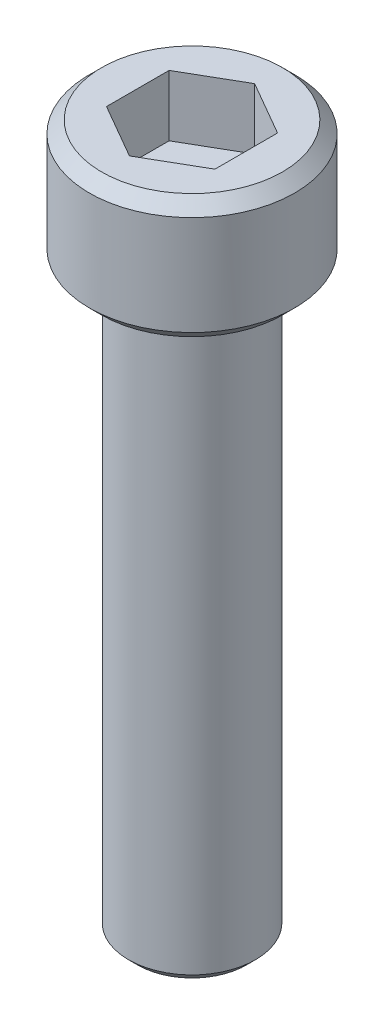
ISO-10303-21;
HEADER;
FILE_DESCRIPTION(('STEP AP214'),'2;1');
FILE_NAME('part.step','',(''),(''),'','','');
FILE_SCHEMA(('AUTOMOTIVE_DESIGN { 1 0 10303 214 1 1 1 1 }'));
ENDSEC;
DATA;
#1=APPLICATION_CONTEXT('core data for automotive mechanical design processes');
#2=APPLICATION_PROTOCOL_DEFINITION('international standard','automotive_design',2000,#1);
#3=PRODUCT_CONTEXT('',#1,'mechanical');
#4=PRODUCT('Part','Part','',(#3));
#5=PRODUCT_RELATED_PRODUCT_CATEGORY('part','',(#4));
#6=PRODUCT_DEFINITION_FORMATION('','',#4);
#7=PRODUCT_DEFINITION_CONTEXT('part definition',#1,'design');
#8=PRODUCT_DEFINITION('design','',#6,#7);
#9=PRODUCT_DEFINITION_SHAPE('','',#8);
#10=(LENGTH_UNIT() NAMED_UNIT(*) SI_UNIT(.MILLI.,.METRE.));
#11=(NAMED_UNIT(*) PLANE_ANGLE_UNIT() SI_UNIT($,.RADIAN.));
#12=(NAMED_UNIT(*) SI_UNIT($,.STERADIAN.) SOLID_ANGLE_UNIT());
#13=UNCERTAINTY_MEASURE_WITH_UNIT(LENGTH_MEASURE(1.E-05),#10,'distance_accuracy_value','');
#14=(GEOMETRIC_REPRESENTATION_CONTEXT(3) GLOBAL_UNCERTAINTY_ASSIGNED_CONTEXT((#13)) GLOBAL_UNIT_ASSIGNED_CONTEXT((#10,
#11,#12)) REPRESENTATION_CONTEXT('',''));
#15=CARTESIAN_POINT('',(0.,0.,0.));
#16=DIRECTION('',(0.,0.,1.));
#17=DIRECTION('',(1.,0.,0.));
#18=AXIS2_PLACEMENT_3D('',#15,#16,#17);
#19=CARTESIAN_POINT('',(1.778,2.064,3.07958633585746));
#20=DIRECTION('',(0.,1.,0.));
#21=DIRECTION('',(0.,0.,1.));
#22=AXIS2_PLACEMENT_3D('',#19,#20,#21);
#23=PLANE('',#22);
#24=DIRECTION('',(-0.866025403784439,0.,0.5));
#25=VECTOR('',#24,1.);
#26=CARTESIAN_POINT('',(0.,2.064,-2.05305755723831));
#27=LINE('',#26,#25);
#28=CARTESIAN_POINT('',(0.,2.064,-2.05305755723831));
#29=VERTEX_POINT('',#28);
#30=CARTESIAN_POINT('',(-1.778,2.064,-1.02652877861915));
#31=VERTEX_POINT('',#30);
#32=EDGE_CURVE('E67',#29,#31,#27,.T.);
#33=ORIENTED_EDGE('',*,*,#32,.T.);
#34=DIRECTION('',(0.,0.,1.));
#35=VECTOR('',#34,1.);
#36=CARTESIAN_POINT('',(-1.778,2.064,-1.02652877861915));
#37=LINE('',#36,#35);
#38=CARTESIAN_POINT('',(-1.778,2.064,1.02652877861916));
#39=VERTEX_POINT('',#38);
#40=EDGE_CURVE('E69',#31,#39,#37,.T.);
#41=ORIENTED_EDGE('',*,*,#40,.T.);
#42=DIRECTION('',(0.866025403784439,0.,0.499999999999999));
#43=VECTOR('',#42,1.);
#44=CARTESIAN_POINT('',(-1.778,2.064,1.02652877861916));
#45=LINE('',#44,#43);
#46=CARTESIAN_POINT('',(0.,2.064,2.05305755723831));
#47=VERTEX_POINT('',#46);
#48=EDGE_CURVE('E71',#39,#47,#45,.T.);
#49=ORIENTED_EDGE('',*,*,#48,.T.);
#50=DIRECTION('',(0.866025403784438,0.,-0.500000000000001));
#51=VECTOR('',#50,1.);
#52=CARTESIAN_POINT('',(0.,2.064,2.05305755723831));
#53=LINE('',#52,#51);
#54=CARTESIAN_POINT('',(1.778,2.064,1.02652877861915));
#55=VERTEX_POINT('',#54);
#56=EDGE_CURVE('E126',#47,#55,#53,.T.);
#57=ORIENTED_EDGE('',*,*,#56,.T.);
#58=DIRECTION('',(0.,0.,-1.));
#59=VECTOR('',#58,1.);
#60=CARTESIAN_POINT('',(1.778,2.064,1.02652877861915));
#61=LINE('',#60,#59);
#62=CARTESIAN_POINT('',(1.778,2.064,-1.02652877861916));
#63=VERTEX_POINT('',#62);
#64=EDGE_CURVE('E131',#55,#63,#61,.T.);
#65=ORIENTED_EDGE('',*,*,#64,.T.);
#66=DIRECTION('',(-0.866025403784439,0.,-0.499999999999999));
#67=VECTOR('',#66,1.);
#68=CARTESIAN_POINT('',(1.778,2.064,-1.02652877861916));
#69=LINE('',#68,#67);
#70=EDGE_CURVE('E135',#63,#29,#69,.T.);
#71=ORIENTED_EDGE('',*,*,#70,.T.);
#72=EDGE_LOOP('',(#33,#41,#49,#57,#65,#71));
#73=FACE_BOUND('',#72,.T.);
#74=ADVANCED_FACE('F16',(#73),#23,.T.);
#75=CARTESIAN_POINT('',(-1.778,2.064,1.02652877861916));
#76=DIRECTION('',(-0.499999999999999,0.,0.866025403784439));
#77=DIRECTION('',(0.866025403784439,0.,0.499999999999999));
#78=AXIS2_PLACEMENT_3D('',#75,#76,#77);
#79=PLANE('',#78);
#80=DIRECTION('',(0.,1.,0.));
#81=VECTOR('',#80,1.);
#82=CARTESIAN_POINT('',(0.,2.064,2.05305755723831));
#83=LINE('',#82,#81);
#84=CARTESIAN_POINT('',(0.,4.064,2.05305755723831));
#85=VERTEX_POINT('',#84);
#86=EDGE_CURVE('E82',#85,#47,#83,.F.);
#87=ORIENTED_EDGE('',*,*,#86,.T.);
#88=ORIENTED_EDGE('',*,*,#48,.F.);
#89=DIRECTION('',(0.,1.,0.));
#90=VECTOR('',#89,1.);
#91=CARTESIAN_POINT('',(-1.778,2.064,1.02652877861916));
#92=LINE('',#91,#90);
#93=CARTESIAN_POINT('',(-1.778,4.064,1.02652877861916));
#94=VERTEX_POINT('',#93);
#95=EDGE_CURVE('E76',#39,#94,#92,.T.);
#96=ORIENTED_EDGE('',*,*,#95,.T.);
#97=DIRECTION('',(-0.866025403784439,0.,-0.5));
#98=VECTOR('',#97,1.);
#99=CARTESIAN_POINT('',(0.,4.064,2.05305755723831));
#100=LINE('',#99,#98);
#101=EDGE_CURVE('E123',#85,#94,#100,.T.);
#102=ORIENTED_EDGE('',*,*,#101,.F.);
#103=EDGE_LOOP('',(#87,#88,#96,#102));
#104=FACE_BOUND('',#103,.T.);
#105=ADVANCED_FACE('F79',(#104),#79,.F.);
#106=CARTESIAN_POINT('',(-1.778,2.064,-1.02652877861915));
#107=DIRECTION('',(-1.,0.,0.));
#108=DIRECTION('',(0.,0.,1.));
#109=AXIS2_PLACEMENT_3D('',#106,#107,#108);
#110=PLANE('',#109);
#111=ORIENTED_EDGE('',*,*,#95,.F.);
#112=ORIENTED_EDGE('',*,*,#40,.F.);
#113=DIRECTION('',(0.,1.,0.));
#114=VECTOR('',#113,1.);
#115=CARTESIAN_POINT('',(-1.778,2.064,-1.02652877861915));
#116=LINE('',#115,#114);
#117=CARTESIAN_POINT('',(-1.778,4.064,-1.02652877861915));
#118=VERTEX_POINT('',#117);
#119=EDGE_CURVE('E90',#31,#118,#116,.T.);
#120=ORIENTED_EDGE('',*,*,#119,.T.);
#121=DIRECTION('',(0.,0.,1.));
#122=VECTOR('',#121,1.);
#123=CARTESIAN_POINT('',(-1.778,4.064,0.));
#124=LINE('',#123,#122);
#125=EDGE_CURVE('E87',#94,#118,#124,.F.);
#126=ORIENTED_EDGE('',*,*,#125,.F.);
#127=EDGE_LOOP('',(#111,#112,#120,#126));
#128=FACE_BOUND('',#127,.T.);
#129=ADVANCED_FACE('F85',(#128),#110,.F.);
#130=CARTESIAN_POINT('',(0.,2.064,-2.05305755723831));
#131=DIRECTION('',(-0.5,0.,-0.866025403784439));
#132=DIRECTION('',(-0.866025403784439,0.,0.5));
#133=AXIS2_PLACEMENT_3D('',#130,#131,#132);
#134=PLANE('',#133);
#135=ORIENTED_EDGE('',*,*,#119,.F.);
#136=ORIENTED_EDGE('',*,*,#32,.F.);
#137=DIRECTION('',(0.,1.,0.));
#138=VECTOR('',#137,1.);
#139=CARTESIAN_POINT('',(0.,2.064,-2.05305755723831));
#140=LINE('',#139,#138);
#141=CARTESIAN_POINT('',(0.,4.064,-2.05305755723831));
#142=VERTEX_POINT('',#141);
#143=EDGE_CURVE('E133',#29,#142,#140,.T.);
#144=ORIENTED_EDGE('',*,*,#143,.T.);
#145=DIRECTION('',(0.866025403784438,0.,-0.5));
#146=VECTOR('',#145,1.);
#147=CARTESIAN_POINT('',(-1.778,4.064,-1.02652877861915));
#148=LINE('',#147,#146);
#149=EDGE_CURVE('E119',#118,#142,#148,.T.);
#150=ORIENTED_EDGE('',*,*,#149,.F.);
#151=EDGE_LOOP('',(#135,#136,#144,#150));
#152=FACE_BOUND('',#151,.T.);
#153=ADVANCED_FACE('F138',(#152),#134,.F.);
#154=CARTESIAN_POINT('',(1.778,2.064,-1.02652877861916));
#155=DIRECTION('',(0.499999999999999,0.,-0.866025403784439));
#156=DIRECTION('',(-0.866025403784439,0.,-0.499999999999999));
#157=AXIS2_PLACEMENT_3D('',#154,#155,#156);
#158=PLANE('',#157);
#159=ORIENTED_EDGE('',*,*,#143,.F.);
#160=ORIENTED_EDGE('',*,*,#70,.F.);
#161=DIRECTION('',(0.,1.,0.));
#162=VECTOR('',#161,1.);
#163=CARTESIAN_POINT('',(1.778,2.064,-1.02652877861916));
#164=LINE('',#163,#162);
#165=CARTESIAN_POINT('',(1.778,4.064,-1.02652877861916));
#166=VERTEX_POINT('',#165);
#167=EDGE_CURVE('E129',#63,#166,#164,.T.);
#168=ORIENTED_EDGE('',*,*,#167,.T.);
#169=DIRECTION('',(0.866025403784439,0.,0.5));
#170=VECTOR('',#169,1.);
#171=CARTESIAN_POINT('',(0.,4.064,-2.05305755723831));
#172=LINE('',#171,#170);
#173=EDGE_CURVE('E116',#142,#166,#172,.T.);
#174=ORIENTED_EDGE('',*,*,#173,.F.);
#175=EDGE_LOOP('',(#159,#160,#168,#174));
#176=FACE_BOUND('',#175,.T.);
#177=ADVANCED_FACE('F150',(#176),#158,.F.);
#178=CARTESIAN_POINT('',(1.778,2.064,1.02652877861915));
#179=DIRECTION('',(1.,0.,0.));
#180=DIRECTION('',(0.,0.,-1.));
#181=AXIS2_PLACEMENT_3D('',#178,#179,#180);
#182=PLANE('',#181);
#183=ORIENTED_EDGE('',*,*,#167,.F.);
#184=ORIENTED_EDGE('',*,*,#64,.F.);
#185=DIRECTION('',(0.,1.,0.));
#186=VECTOR('',#185,1.);
#187=CARTESIAN_POINT('',(1.778,2.064,1.02652877861915));
#188=LINE('',#187,#186);
#189=CARTESIAN_POINT('',(1.778,4.064,1.02652877861915));
#190=VERTEX_POINT('',#189);
#191=EDGE_CURVE('E34',#55,#190,#188,.T.);
#192=ORIENTED_EDGE('',*,*,#191,.T.);
#193=DIRECTION('',(0.,0.,1.));
#194=VECTOR('',#193,1.);
#195=CARTESIAN_POINT('',(1.778,4.064,0.));
#196=LINE('',#195,#194);
#197=EDGE_CURVE('E113',#166,#190,#196,.T.);
#198=ORIENTED_EDGE('',*,*,#197,.F.);
#199=EDGE_LOOP('',(#183,#184,#192,#198));
#200=FACE_BOUND('',#199,.T.);
#201=ADVANCED_FACE('F148',(#200),#182,.F.);
#202=CARTESIAN_POINT('',(0.,2.064,2.05305755723831));
#203=DIRECTION('',(0.500000000000001,0.,0.866025403784438));
#204=DIRECTION('',(0.866025403784438,0.,-0.500000000000001));
#205=AXIS2_PLACEMENT_3D('',#202,#203,#204);
#206=PLANE('',#205);
#207=ORIENTED_EDGE('',*,*,#191,.F.);
#208=ORIENTED_EDGE('',*,*,#56,.F.);
#209=ORIENTED_EDGE('',*,*,#86,.F.);
#210=DIRECTION('',(-0.866025403784438,0.,0.500000000000001));
#211=VECTOR('',#210,1.);
#212=CARTESIAN_POINT('',(1.778,4.064,1.02652877861915));
#213=LINE('',#212,#211);
#214=EDGE_CURVE('E110',#190,#85,#213,.T.);
#215=ORIENTED_EDGE('',*,*,#214,.F.);
#216=EDGE_LOOP('',(#207,#208,#209,#215));
#217=FACE_BOUND('',#216,.T.);
#218=ADVANCED_FACE('F145',(#217),#206,.F.);
#219=CARTESIAN_POINT('',(0.,4.064,0.));
#220=DIRECTION('',(0.,1.,0.));
#221=DIRECTION('',(0.,0.,1.));
#222=AXIS2_PLACEMENT_3D('',#219,#220,#221);
#223=PLANE('',#222);
#224=ORIENTED_EDGE('',*,*,#197,.T.);
#225=ORIENTED_EDGE('',*,*,#214,.T.);
#226=ORIENTED_EDGE('',*,*,#101,.T.);
#227=ORIENTED_EDGE('',*,*,#125,.T.);
#228=ORIENTED_EDGE('',*,*,#149,.T.);
#229=ORIENTED_EDGE('',*,*,#173,.T.);
#230=EDGE_LOOP('',(#224,#225,#226,#227,#228,#229));
#231=FACE_BOUND('',#230,.T.);
#232=CARTESIAN_POINT('',(0.,4.06400000002805,0.));
#233=DIRECTION('',(0.,-1.,0.));
#234=DIRECTION('',(1.,0.,0.));
#235=AXIS2_PLACEMENT_3D('',#232,#233,#234);
#236=CIRCLE('',#235,2.96550000007301);
#237=CARTESIAN_POINT('',(2.96550000007301,4.06400000002805,0.));
#238=VERTEX_POINT('',#237);
#239=EDGE_CURVE('E19',#238,#238,#236,.T.);
#240=ORIENTED_EDGE('',*,*,#239,.F.);
#241=EDGE_LOOP('',(#240));
#242=FACE_BOUND('',#241,.T.);
#243=ADVANCED_FACE('F142',(#231,#242),#223,.T.);
#244=CARTESIAN_POINT('',(0.,3.66400000007161,0.));
#245=DIRECTION('',(0.,-1.,0.));
#246=DIRECTION('',(1.,0.,0.));
#247=AXIS2_PLACEMENT_3D('',#244,#245,#246);
#248=CONICAL_SURFACE('',#247,3.36550000002944,0.785398163397448);
#249=ORIENTED_EDGE('',*,*,#239,.T.);
#250=EDGE_LOOP('',(#249));
#251=FACE_BOUND('',#250,.T.);
#252=CARTESIAN_POINT('',(0.,3.664,0.));
#253=DIRECTION('',(0.,-1.,0.));
#254=DIRECTION('',(0.,0.,-1.));
#255=AXIS2_PLACEMENT_3D('',#252,#253,#254);
#256=CIRCLE('',#255,3.3655);
#257=CARTESIAN_POINT('',(0.,3.664,-3.3655));
#258=VERTEX_POINT('',#257);
#259=EDGE_CURVE('E102',#258,#258,#256,.T.);
#260=ORIENTED_EDGE('',*,*,#259,.F.);
#261=EDGE_LOOP('',(#260));
#262=FACE_BOUND('',#261,.T.);
#263=ADVANCED_FACE('F187',(#251,#262),#248,.T.);
#264=CARTESIAN_POINT('',(0.,4.064,0.));
#265=DIRECTION('',(0.,-1.,0.));
#266=DIRECTION('',(0.,0.,-1.));
#267=AXIS2_PLACEMENT_3D('',#264,#265,#266);
#268=CYLINDRICAL_SURFACE('',#267,3.3655);
#269=ORIENTED_EDGE('',*,*,#259,.T.);
#270=EDGE_LOOP('',(#269));
#271=FACE_BOUND('',#270,.T.);
#272=CARTESIAN_POINT('',(0.,0.400000000013279,0.));
#273=DIRECTION('',(0.,1.,0.));
#274=DIRECTION('',(0.,0.,1.));
#275=AXIS2_PLACEMENT_3D('',#272,#273,#274);
#276=CIRCLE('',#275,3.36549999991576);
#277=CARTESIAN_POINT('',(0.,0.400000000013279,3.36549999991576));
#278=VERTEX_POINT('',#277);
#279=EDGE_CURVE('E98',#278,#278,#276,.F.);
#280=ORIENTED_EDGE('',*,*,#279,.F.);
#281=EDGE_LOOP('',(#280));
#282=FACE_BOUND('',#281,.T.);
#283=ADVANCED_FACE('F183',(#271,#282),#268,.T.);
#284=CARTESIAN_POINT('',(0.,-19.05,0.));
#285=DIRECTION('',(0.,1.,0.));
#286=DIRECTION('',(0.,0.,1.));
#287=AXIS2_PLACEMENT_3D('',#284,#285,#286);
#288=PLANE('',#287);
#289=CARTESIAN_POINT('',(0.,-19.0499999999929,0.));
#290=DIRECTION('',(0.,1.,0.));
#291=DIRECTION('',(0.,0.,1.));
#292=AXIS2_PLACEMENT_3D('',#289,#290,#291);
#293=CIRCLE('',#292,1.78279999994402);
#294=CARTESIAN_POINT('',(0.,-19.0499999999929,1.78279999994402));
#295=VERTEX_POINT('',#294);
#296=EDGE_CURVE('E96',#295,#295,#293,.T.);
#297=ORIENTED_EDGE('',*,*,#296,.F.);
#298=EDGE_LOOP('',(#297));
#299=FACE_BOUND('',#298,.T.);
#300=ADVANCED_FACE('F179',(#299),#288,.F.);
#301=CARTESIAN_POINT('',(0.,0.400000000013279,0.));
#302=DIRECTION('',(0.,1.,0.));
#303=DIRECTION('',(0.,0.,1.));
#304=AXIS2_PLACEMENT_3D('',#301,#302,#303);
#305=CONICAL_SURFACE('',#304,3.36549999991576,0.785398163326394);
#306=CARTESIAN_POINT('',(0.,5.6843418860808E-11,0.));
#307=DIRECTION('',(0.,1.,0.));
#308=DIRECTION('',(0.,0.,1.));
#309=AXIS2_PLACEMENT_3D('',#306,#307,#308);
#310=CIRCLE('',#309,2.96550000001616);
#311=CARTESIAN_POINT('',(0.,5.6843418860808E-11,2.96550000001616));
#312=VERTEX_POINT('',#311);
#313=EDGE_CURVE('E94',#312,#312,#310,.T.);
#314=ORIENTED_EDGE('',*,*,#313,.T.);
#315=EDGE_LOOP('',(#314));
#316=FACE_BOUND('',#315,.T.);
#317=ORIENTED_EDGE('',*,*,#279,.T.);
#318=EDGE_LOOP('',(#317));
#319=FACE_BOUND('',#318,.T.);
#320=ADVANCED_FACE('F175',(#316,#319),#305,.T.);
#321=CARTESIAN_POINT('',(0.,-18.7500000000114,0.));
#322=DIRECTION('',(0.,1.,0.));
#323=DIRECTION('',(0.,0.,1.));
#324=AXIS2_PLACEMENT_3D('',#321,#322,#323);
#325=CONICAL_SURFACE('',#324,2.08279999992556,0.785398163397448);
#326=CARTESIAN_POINT('',(0.,-18.75,0.));
#327=DIRECTION('',(0.,1.,0.));
#328=DIRECTION('',(0.,0.,1.));
#329=AXIS2_PLACEMENT_3D('',#326,#327,#328);
#330=CIRCLE('',#329,2.0828);
#331=CARTESIAN_POINT('',(0.,-18.75,2.0828));
#332=VERTEX_POINT('',#331);
#333=EDGE_CURVE('E25',#332,#332,#330,.T.);
#334=ORIENTED_EDGE('',*,*,#333,.F.);
#335=EDGE_LOOP('',(#334));
#336=FACE_BOUND('',#335,.T.);
#337=ORIENTED_EDGE('',*,*,#296,.T.);
#338=EDGE_LOOP('',(#337));
#339=FACE_BOUND('',#338,.T.);
#340=ADVANCED_FACE('F168',(#336,#339),#325,.T.);
#341=CARTESIAN_POINT('',(0.,0.,0.));
#342=DIRECTION('',(0.,1.,0.));
#343=DIRECTION('',(0.,0.,1.));
#344=AXIS2_PLACEMENT_3D('',#341,#342,#343);
#345=PLANE('',#344);
#346=CARTESIAN_POINT('',(0.,0.,0.));
#347=DIRECTION('',(0.,1.,0.));
#348=DIRECTION('',(0.,0.,1.));
#349=AXIS2_PLACEMENT_3D('',#346,#347,#348);
#350=CIRCLE('',#349,2.0828);
#351=CARTESIAN_POINT('',(0.,0.,2.0828));
#352=VERTEX_POINT('',#351);
#353=EDGE_CURVE('E11',#352,#352,#350,.F.);
#354=ORIENTED_EDGE('',*,*,#353,.F.);
#355=EDGE_LOOP('',(#354));
#356=FACE_BOUND('',#355,.T.);
#357=ORIENTED_EDGE('',*,*,#313,.F.);
#358=EDGE_LOOP('',(#357));
#359=FACE_BOUND('',#358,.T.);
#360=ADVANCED_FACE('F162',(#356,#359),#345,.F.);
#361=CARTESIAN_POINT('',(0.,-19.05,0.));
#362=DIRECTION('',(0.,1.,0.));
#363=DIRECTION('',(0.,0.,1.));
#364=AXIS2_PLACEMENT_3D('',#361,#362,#363);
#365=CYLINDRICAL_SURFACE('',#364,2.0828);
#366=ORIENTED_EDGE('',*,*,#353,.T.);
#367=EDGE_LOOP('',(#366));
#368=FACE_BOUND('',#367,.T.);
#369=ORIENTED_EDGE('',*,*,#333,.T.);
#370=EDGE_LOOP('',(#369));
#371=FACE_BOUND('',#370,.T.);
#372=ADVANCED_FACE('F160',(#368,#371),#365,.T.);
#373=CLOSED_SHELL('',(#74,#105,#129,#153,#177,#201,#218,#243,#263,#283,#300,#320,#340,#360,#372));
#374=MANIFOLD_SOLID_BREP('B1',#373);
#375=ADVANCED_BREP_SHAPE_REPRESENTATION('',(#18,#374),#14);
#376=SHAPE_DEFINITION_REPRESENTATION(#9,#375);
ENDSEC;
END-ISO-10303-21;
